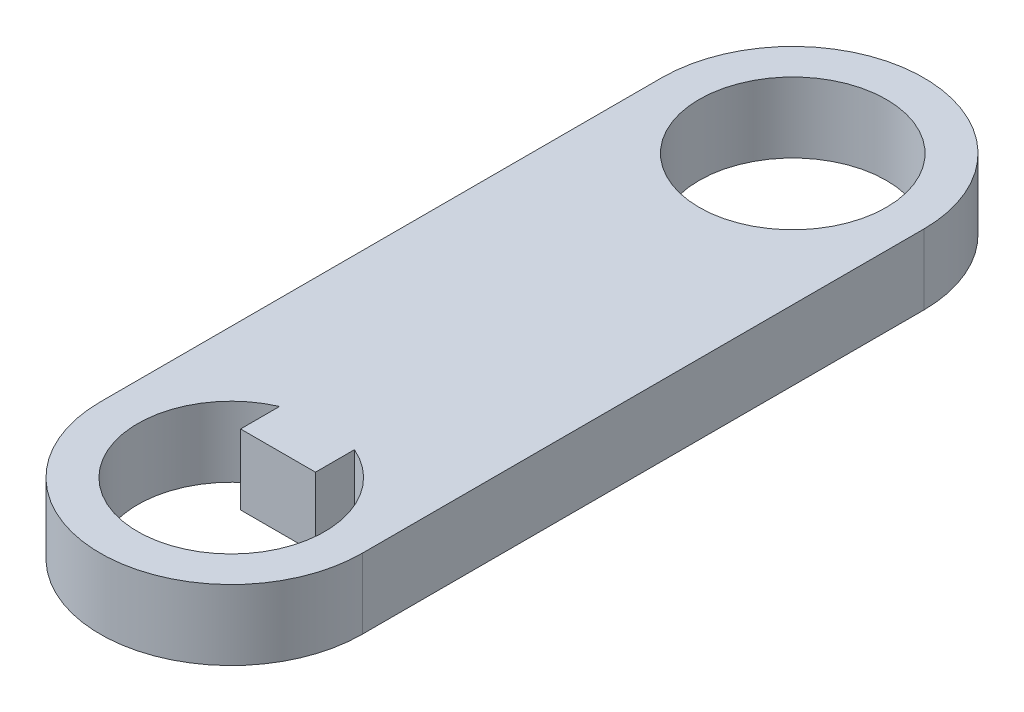
ISO-10303-21;
HEADER;
FILE_DESCRIPTION(('STEP AP214'),'2;1');
FILE_NAME('part.step','',(''),(''),'','','');
FILE_SCHEMA(('AUTOMOTIVE_DESIGN { 1 0 10303 214 1 1 1 1 }'));
ENDSEC;
DATA;
#1=APPLICATION_CONTEXT('core data for automotive mechanical design processes');
#2=APPLICATION_PROTOCOL_DEFINITION('international standard','automotive_design',2000,#1);
#3=PRODUCT_CONTEXT('',#1,'mechanical');
#4=PRODUCT('Part','Part','',(#3));
#5=PRODUCT_RELATED_PRODUCT_CATEGORY('part','',(#4));
#6=PRODUCT_DEFINITION_FORMATION('','',#4);
#7=PRODUCT_DEFINITION_CONTEXT('part definition',#1,'design');
#8=PRODUCT_DEFINITION('design','',#6,#7);
#9=PRODUCT_DEFINITION_SHAPE('','',#8);
#10=(LENGTH_UNIT() NAMED_UNIT(*) SI_UNIT(.MILLI.,.METRE.));
#11=(NAMED_UNIT(*) PLANE_ANGLE_UNIT() SI_UNIT($,.RADIAN.));
#12=(NAMED_UNIT(*) SI_UNIT($,.STERADIAN.) SOLID_ANGLE_UNIT());
#13=UNCERTAINTY_MEASURE_WITH_UNIT(LENGTH_MEASURE(1.E-05),#10,'distance_accuracy_value','');
#14=(GEOMETRIC_REPRESENTATION_CONTEXT(3) GLOBAL_UNCERTAINTY_ASSIGNED_CONTEXT((#13)) GLOBAL_UNIT_ASSIGNED_CONTEXT((#10,
#11,#12)) REPRESENTATION_CONTEXT('',''));
#15=CARTESIAN_POINT('',(0.,0.,0.));
#16=DIRECTION('',(0.,0.,1.));
#17=DIRECTION('',(1.,0.,0.));
#18=AXIS2_PLACEMENT_3D('',#15,#16,#17);
#19=CARTESIAN_POINT('',(0.,7.5,0.));
#20=DIRECTION('',(0.,-1.,0.));
#21=DIRECTION('',(0.,0.,-1.));
#22=AXIS2_PLACEMENT_3D('',#19,#20,#21);
#23=CYLINDRICAL_SURFACE('',#22,14.);
#24=CARTESIAN_POINT('',(0.,0.,0.));
#25=DIRECTION('',(0.,1.,0.));
#26=DIRECTION('',(0.,0.,1.));
#27=AXIS2_PLACEMENT_3D('',#24,#25,#26);
#28=CIRCLE('',#27,14.);
#29=CARTESIAN_POINT('',(-14.,0.,0.));
#30=VERTEX_POINT('',#29);
#31=CARTESIAN_POINT('',(14.,0.,0.));
#32=VERTEX_POINT('',#31);
#33=EDGE_CURVE('E163',#30,#32,#28,.T.);
#34=ORIENTED_EDGE('',*,*,#33,.T.);
#35=DIRECTION('',(0.,-1.,0.));
#36=VECTOR('',#35,1.);
#37=CARTESIAN_POINT('',(14.,7.5,0.));
#38=LINE('',#37,#36);
#39=CARTESIAN_POINT('',(14.,7.5,0.));
#40=VERTEX_POINT('',#39);
#41=EDGE_CURVE('E68',#40,#32,#38,.T.);
#42=ORIENTED_EDGE('',*,*,#41,.F.);
#43=CARTESIAN_POINT('',(0.,7.5,0.));
#44=DIRECTION('',(0.,1.,0.));
#45=DIRECTION('',(0.,0.,1.));
#46=AXIS2_PLACEMENT_3D('',#43,#44,#45);
#47=CIRCLE('',#46,14.);
#48=CARTESIAN_POINT('',(-14.,7.5,0.));
#49=VERTEX_POINT('',#48);
#50=EDGE_CURVE('E177',#49,#40,#47,.T.);
#51=ORIENTED_EDGE('',*,*,#50,.F.);
#52=DIRECTION('',(0.,-1.,0.));
#53=VECTOR('',#52,1.);
#54=CARTESIAN_POINT('',(-14.,7.5,0.));
#55=LINE('',#54,#53);
#56=EDGE_CURVE('E12',#49,#30,#55,.T.);
#57=ORIENTED_EDGE('',*,*,#56,.T.);
#58=EDGE_LOOP('',(#34,#42,#51,#57));
#59=FACE_BOUND('',#58,.T.);
#60=ADVANCED_FACE('F58',(#59),#23,.T.);
#61=CARTESIAN_POINT('',(14.,7.5,0.));
#62=DIRECTION('',(1.,0.,0.));
#63=DIRECTION('',(0.,0.,-1.));
#64=AXIS2_PLACEMENT_3D('',#61,#62,#63);
#65=PLANE('',#64);
#66=DIRECTION('',(0.,0.,1.));
#67=VECTOR('',#66,1.);
#68=CARTESIAN_POINT('',(14.,0.,0.));
#69=LINE('',#68,#67);
#70=CARTESIAN_POINT('',(14.,0.,-60.));
#71=VERTEX_POINT('',#70);
#72=EDGE_CURVE('E160',#71,#32,#69,.T.);
#73=ORIENTED_EDGE('',*,*,#72,.F.);
#74=DIRECTION('',(0.,-1.,0.));
#75=VECTOR('',#74,1.);
#76=CARTESIAN_POINT('',(14.,7.5,-60.));
#77=LINE('',#76,#75);
#78=CARTESIAN_POINT('',(14.,7.5,-60.));
#79=VERTEX_POINT('',#78);
#80=EDGE_CURVE('E153',#79,#71,#77,.T.);
#81=ORIENTED_EDGE('',*,*,#80,.F.);
#82=DIRECTION('',(0.,0.,1.));
#83=VECTOR('',#82,1.);
#84=CARTESIAN_POINT('',(14.,7.5,0.));
#85=LINE('',#84,#83);
#86=EDGE_CURVE('E174',#79,#40,#85,.T.);
#87=ORIENTED_EDGE('',*,*,#86,.T.);
#88=ORIENTED_EDGE('',*,*,#41,.T.);
#89=EDGE_LOOP('',(#73,#81,#87,#88));
#90=FACE_BOUND('',#89,.T.);
#91=ADVANCED_FACE('F208',(#90),#65,.T.);
#92=CARTESIAN_POINT('',(0.,7.5,-60.));
#93=DIRECTION('',(0.,-1.,0.));
#94=DIRECTION('',(0.,0.,-1.));
#95=AXIS2_PLACEMENT_3D('',#92,#93,#94);
#96=CYLINDRICAL_SURFACE('',#95,14.);
#97=CARTESIAN_POINT('',(0.,0.,-60.));
#98=DIRECTION('',(0.,1.,0.));
#99=DIRECTION('',(0.,0.,1.));
#100=AXIS2_PLACEMENT_3D('',#97,#98,#99);
#101=CIRCLE('',#100,14.);
#102=CARTESIAN_POINT('',(-14.,0.,-60.));
#103=VERTEX_POINT('',#102);
#104=EDGE_CURVE('E157',#71,#103,#101,.T.);
#105=ORIENTED_EDGE('',*,*,#104,.T.);
#106=DIRECTION('',(0.,-1.,0.));
#107=VECTOR('',#106,1.);
#108=CARTESIAN_POINT('',(-14.,7.5,-60.));
#109=LINE('',#108,#107);
#110=CARTESIAN_POINT('',(-14.,7.5,-60.));
#111=VERTEX_POINT('',#110);
#112=EDGE_CURVE('E149',#111,#103,#109,.T.);
#113=ORIENTED_EDGE('',*,*,#112,.F.);
#114=CARTESIAN_POINT('',(0.,7.5,-60.));
#115=DIRECTION('',(0.,1.,0.));
#116=DIRECTION('',(0.,0.,1.));
#117=AXIS2_PLACEMENT_3D('',#114,#115,#116);
#118=CIRCLE('',#117,14.);
#119=EDGE_CURVE('E77',#79,#111,#118,.T.);
#120=ORIENTED_EDGE('',*,*,#119,.F.);
#121=ORIENTED_EDGE('',*,*,#80,.T.);
#122=EDGE_LOOP('',(#105,#113,#120,#121));
#123=FACE_BOUND('',#122,.T.);
#124=ADVANCED_FACE('F211',(#123),#96,.T.);
#125=CARTESIAN_POINT('',(-14.,7.5,0.));
#126=DIRECTION('',(1.,0.,0.));
#127=DIRECTION('',(0.,0.,-1.));
#128=AXIS2_PLACEMENT_3D('',#125,#126,#127);
#129=PLANE('',#128);
#130=DIRECTION('',(0.,0.,1.));
#131=VECTOR('',#130,1.);
#132=CARTESIAN_POINT('',(-14.,0.,0.));
#133=LINE('',#132,#131);
#134=EDGE_CURVE('E166',#103,#30,#133,.T.);
#135=ORIENTED_EDGE('',*,*,#134,.T.);
#136=ORIENTED_EDGE('',*,*,#56,.F.);
#137=DIRECTION('',(0.,0.,1.));
#138=VECTOR('',#137,1.);
#139=CARTESIAN_POINT('',(-14.,7.5,0.));
#140=LINE('',#139,#138);
#141=EDGE_CURVE('E180',#111,#49,#140,.T.);
#142=ORIENTED_EDGE('',*,*,#141,.F.);
#143=ORIENTED_EDGE('',*,*,#112,.T.);
#144=EDGE_LOOP('',(#135,#136,#142,#143));
#145=FACE_BOUND('',#144,.T.);
#146=ADVANCED_FACE('F203',(#145),#129,.F.);
#147=CARTESIAN_POINT('',(0.,7.5,0.));
#148=DIRECTION('',(0.,-1.,0.));
#149=DIRECTION('',(0.,0.,-1.));
#150=AXIS2_PLACEMENT_3D('',#147,#148,#149);
#151=CYLINDRICAL_SURFACE('',#150,10.);
#152=CARTESIAN_POINT('',(0.,0.,0.));
#153=DIRECTION('',(0.,1.,0.));
#154=DIRECTION('',(0.,0.,1.));
#155=AXIS2_PLACEMENT_3D('',#152,#153,#154);
#156=CIRCLE('',#155,10.);
#157=CARTESIAN_POINT('',(-4.,0.,-9.16515138991168));
#158=VERTEX_POINT('',#157);
#159=CARTESIAN_POINT('',(4.,0.,-9.16515138991168));
#160=VERTEX_POINT('',#159);
#161=EDGE_CURVE('E134',#158,#160,#156,.T.);
#162=ORIENTED_EDGE('',*,*,#161,.F.);
#163=DIRECTION('',(0.,-1.,0.));
#164=VECTOR('',#163,1.);
#165=CARTESIAN_POINT('',(-4.,7.5,-9.16515138991168));
#166=LINE('',#165,#164);
#167=CARTESIAN_POINT('',(-4.,7.5,-9.16515138991168));
#168=VERTEX_POINT('',#167);
#169=EDGE_CURVE('E147',#168,#158,#166,.T.);
#170=ORIENTED_EDGE('',*,*,#169,.F.);
#171=CARTESIAN_POINT('',(0.,7.5,0.));
#172=DIRECTION('',(0.,1.,0.));
#173=DIRECTION('',(0.,0.,1.));
#174=AXIS2_PLACEMENT_3D('',#171,#172,#173);
#175=CIRCLE('',#174,10.);
#176=CARTESIAN_POINT('',(4.,7.5,-9.16515138991168));
#177=VERTEX_POINT('',#176);
#178=EDGE_CURVE('E182',#168,#177,#175,.T.);
#179=ORIENTED_EDGE('',*,*,#178,.T.);
#180=DIRECTION('',(0.,-1.,0.));
#181=VECTOR('',#180,1.);
#182=CARTESIAN_POINT('',(4.,7.5,-9.16515138991168));
#183=LINE('',#182,#181);
#184=EDGE_CURVE('E150',#177,#160,#183,.T.);
#185=ORIENTED_EDGE('',*,*,#184,.T.);
#186=EDGE_LOOP('',(#162,#170,#179,#185));
#187=FACE_BOUND('',#186,.T.);
#188=ADVANCED_FACE('F218',(#187),#151,.F.);
#189=CARTESIAN_POINT('',(0.,7.5,-60.));
#190=DIRECTION('',(0.,-1.,0.));
#191=DIRECTION('',(0.,0.,-1.));
#192=AXIS2_PLACEMENT_3D('',#189,#190,#191);
#193=CYLINDRICAL_SURFACE('',#192,10.);
#194=CARTESIAN_POINT('',(0.,7.5,-60.));
#195=DIRECTION('',(0.,1.,0.));
#196=DIRECTION('',(0.,0.,1.));
#197=AXIS2_PLACEMENT_3D('',#194,#195,#196);
#198=CIRCLE('',#197,10.);
#199=CARTESIAN_POINT('',(0.,7.5,-50.));
#200=VERTEX_POINT('',#199);
#201=EDGE_CURVE('E159',#200,#200,#198,.T.);
#202=ORIENTED_EDGE('',*,*,#201,.T.);
#203=EDGE_LOOP('',(#202));
#204=FACE_BOUND('',#203,.T.);
#205=CARTESIAN_POINT('',(0.,0.,-60.));
#206=DIRECTION('',(0.,1.,0.));
#207=DIRECTION('',(0.,0.,1.));
#208=AXIS2_PLACEMENT_3D('',#205,#206,#207);
#209=CIRCLE('',#208,10.);
#210=CARTESIAN_POINT('',(0.,0.,-50.));
#211=VERTEX_POINT('',#210);
#212=EDGE_CURVE('E170',#211,#211,#209,.T.);
#213=ORIENTED_EDGE('',*,*,#212,.F.);
#214=EDGE_LOOP('',(#213));
#215=FACE_BOUND('',#214,.T.);
#216=ADVANCED_FACE('F188',(#204,#215),#193,.F.);
#217=CARTESIAN_POINT('',(0.,0.,0.));
#218=DIRECTION('',(0.,1.,0.));
#219=DIRECTION('',(0.,0.,1.));
#220=AXIS2_PLACEMENT_3D('',#217,#218,#219);
#221=PLANE('',#220);
#222=DIRECTION('',(0.,0.,-1.));
#223=VECTOR('',#222,1.);
#224=CARTESIAN_POINT('',(-4.,0.,-5.));
#225=LINE('',#224,#223);
#226=CARTESIAN_POINT('',(-4.,0.,-5.));
#227=VERTEX_POINT('',#226);
#228=EDGE_CURVE('E138',#227,#158,#225,.T.);
#229=ORIENTED_EDGE('',*,*,#228,.T.);
#230=ORIENTED_EDGE('',*,*,#161,.T.);
#231=DIRECTION('',(0.,0.,-1.));
#232=VECTOR('',#231,1.);
#233=CARTESIAN_POINT('',(4.,0.,-5.));
#234=LINE('',#233,#232);
#235=CARTESIAN_POINT('',(4.,0.,-5.));
#236=VERTEX_POINT('',#235);
#237=EDGE_CURVE('E122',#236,#160,#234,.T.);
#238=ORIENTED_EDGE('',*,*,#237,.F.);
#239=DIRECTION('',(-1.,0.,0.));
#240=VECTOR('',#239,1.);
#241=CARTESIAN_POINT('',(4.,0.,-5.));
#242=LINE('',#241,#240);
#243=EDGE_CURVE('E132',#236,#227,#242,.T.);
#244=ORIENTED_EDGE('',*,*,#243,.T.);
#245=EDGE_LOOP('',(#229,#230,#238,#244));
#246=FACE_BOUND('',#245,.T.);
#247=ORIENTED_EDGE('',*,*,#212,.T.);
#248=EDGE_LOOP('',(#247));
#249=FACE_BOUND('',#248,.T.);
#250=ORIENTED_EDGE('',*,*,#134,.F.);
#251=ORIENTED_EDGE('',*,*,#104,.F.);
#252=ORIENTED_EDGE('',*,*,#72,.T.);
#253=ORIENTED_EDGE('',*,*,#33,.F.);
#254=EDGE_LOOP('',(#250,#251,#252,#253));
#255=FACE_BOUND('',#254,.T.);
#256=ADVANCED_FACE('F130',(#246,#249,#255),#221,.F.);
#257=CARTESIAN_POINT('',(0.,7.5,0.));
#258=DIRECTION('',(0.,1.,0.));
#259=DIRECTION('',(0.,0.,1.));
#260=AXIS2_PLACEMENT_3D('',#257,#258,#259);
#261=PLANE('',#260);
#262=ORIENTED_EDGE('',*,*,#178,.F.);
#263=DIRECTION('',(0.,0.,-1.));
#264=VECTOR('',#263,1.);
#265=CARTESIAN_POINT('',(-4.,7.5,-5.));
#266=LINE('',#265,#264);
#267=CARTESIAN_POINT('',(-4.,7.5,-5.));
#268=VERTEX_POINT('',#267);
#269=EDGE_CURVE('E135',#268,#168,#266,.T.);
#270=ORIENTED_EDGE('',*,*,#269,.F.);
#271=DIRECTION('',(-1.,0.,0.));
#272=VECTOR('',#271,1.);
#273=CARTESIAN_POINT('',(4.,7.5,-5.));
#274=LINE('',#273,#272);
#275=CARTESIAN_POINT('',(4.,7.5,-5.));
#276=VERTEX_POINT('',#275);
#277=EDGE_CURVE('E143',#276,#268,#274,.T.);
#278=ORIENTED_EDGE('',*,*,#277,.F.);
#279=DIRECTION('',(0.,0.,-1.));
#280=VECTOR('',#279,1.);
#281=CARTESIAN_POINT('',(4.,7.5,-5.));
#282=LINE('',#281,#280);
#283=EDGE_CURVE('E125',#276,#177,#282,.T.);
#284=ORIENTED_EDGE('',*,*,#283,.T.);
#285=EDGE_LOOP('',(#262,#270,#278,#284));
#286=FACE_BOUND('',#285,.T.);
#287=ORIENTED_EDGE('',*,*,#201,.F.);
#288=EDGE_LOOP('',(#287));
#289=FACE_BOUND('',#288,.T.);
#290=ORIENTED_EDGE('',*,*,#141,.T.);
#291=ORIENTED_EDGE('',*,*,#50,.T.);
#292=ORIENTED_EDGE('',*,*,#86,.F.);
#293=ORIENTED_EDGE('',*,*,#119,.T.);
#294=EDGE_LOOP('',(#290,#291,#292,#293));
#295=FACE_BOUND('',#294,.T.);
#296=ADVANCED_FACE('F191',(#286,#289,#295),#261,.T.);
#297=CARTESIAN_POINT('',(-4.,7.5,-5.));
#298=DIRECTION('',(-1.,0.,0.));
#299=DIRECTION('',(0.,0.,1.));
#300=AXIS2_PLACEMENT_3D('',#297,#298,#299);
#301=PLANE('',#300);
#302=ORIENTED_EDGE('',*,*,#269,.T.);
#303=ORIENTED_EDGE('',*,*,#169,.T.);
#304=ORIENTED_EDGE('',*,*,#228,.F.);
#305=DIRECTION('',(0.,-1.,0.));
#306=VECTOR('',#305,1.);
#307=CARTESIAN_POINT('',(-4.,7.5,-5.));
#308=LINE('',#307,#306);
#309=EDGE_CURVE('E62',#268,#227,#308,.T.);
#310=ORIENTED_EDGE('',*,*,#309,.F.);
#311=EDGE_LOOP('',(#302,#303,#304,#310));
#312=FACE_BOUND('',#311,.T.);
#313=ADVANCED_FACE('F60',(#312),#301,.T.);
#314=CARTESIAN_POINT('',(4.,7.5,-5.));
#315=DIRECTION('',(0.,0.,1.));
#316=DIRECTION('',(1.,0.,0.));
#317=AXIS2_PLACEMENT_3D('',#314,#315,#316);
#318=PLANE('',#317);
#319=ORIENTED_EDGE('',*,*,#243,.F.);
#320=DIRECTION('',(0.,-1.,0.));
#321=VECTOR('',#320,1.);
#322=CARTESIAN_POINT('',(4.,7.5,-5.));
#323=LINE('',#322,#321);
#324=EDGE_CURVE('E118',#276,#236,#323,.T.);
#325=ORIENTED_EDGE('',*,*,#324,.F.);
#326=ORIENTED_EDGE('',*,*,#277,.T.);
#327=ORIENTED_EDGE('',*,*,#309,.T.);
#328=EDGE_LOOP('',(#319,#325,#326,#327));
#329=FACE_BOUND('',#328,.T.);
#330=ADVANCED_FACE('F137',(#329),#318,.T.);
#331=CARTESIAN_POINT('',(4.,7.5,-5.));
#332=DIRECTION('',(-1.,0.,0.));
#333=DIRECTION('',(0.,0.,1.));
#334=AXIS2_PLACEMENT_3D('',#331,#332,#333);
#335=PLANE('',#334);
#336=ORIENTED_EDGE('',*,*,#184,.F.);
#337=ORIENTED_EDGE('',*,*,#283,.F.);
#338=ORIENTED_EDGE('',*,*,#324,.T.);
#339=ORIENTED_EDGE('',*,*,#237,.T.);
#340=EDGE_LOOP('',(#336,#337,#338,#339));
#341=FACE_BOUND('',#340,.T.);
#342=ADVANCED_FACE('F121',(#341),#335,.F.);
#343=CLOSED_SHELL('',(#60,#91,#124,#146,#188,#216,#256,#296,#313,#330,#342));
#344=MANIFOLD_SOLID_BREP('B2',#343);
#345=ADVANCED_BREP_SHAPE_REPRESENTATION('',(#18,#344),#14);
#346=SHAPE_DEFINITION_REPRESENTATION(#9,#345);
ENDSEC;
END-ISO-10303-21;
